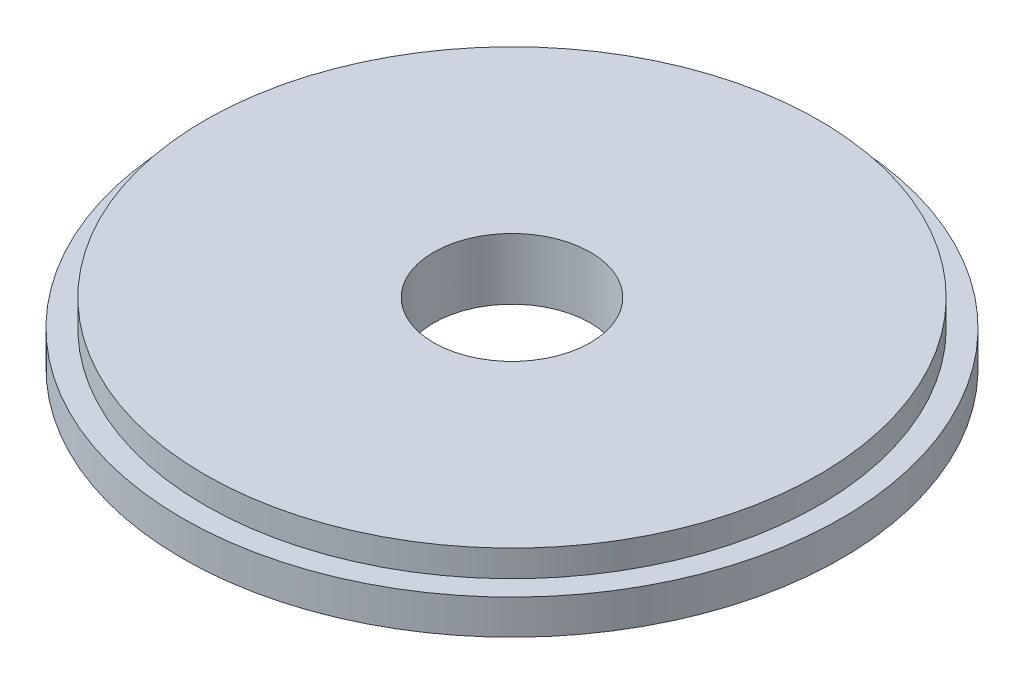
ISO-10303-21;
HEADER;
FILE_DESCRIPTION(('STEP AP214'),'2;1');
FILE_NAME('part.step','',(''),(''),'','','');
FILE_SCHEMA(('AUTOMOTIVE_DESIGN { 1 0 10303 214 1 1 1 1 }'));
ENDSEC;
DATA;
#1=APPLICATION_CONTEXT('core data for automotive mechanical design processes');
#2=APPLICATION_PROTOCOL_DEFINITION('international standard','automotive_design',2000,#1);
#3=PRODUCT_CONTEXT('',#1,'mechanical');
#4=PRODUCT('Part','Part','',(#3));
#5=PRODUCT_RELATED_PRODUCT_CATEGORY('part','',(#4));
#6=PRODUCT_DEFINITION_FORMATION('','',#4);
#7=PRODUCT_DEFINITION_CONTEXT('part definition',#1,'design');
#8=PRODUCT_DEFINITION('design','',#6,#7);
#9=PRODUCT_DEFINITION_SHAPE('','',#8);
#10=(LENGTH_UNIT() NAMED_UNIT(*) SI_UNIT(.MILLI.,.METRE.));
#11=(NAMED_UNIT(*) PLANE_ANGLE_UNIT() SI_UNIT($,.RADIAN.));
#12=(NAMED_UNIT(*) SI_UNIT($,.STERADIAN.) SOLID_ANGLE_UNIT());
#13=UNCERTAINTY_MEASURE_WITH_UNIT(LENGTH_MEASURE(1.E-05),#10,'distance_accuracy_value','');
#14=(GEOMETRIC_REPRESENTATION_CONTEXT(3) GLOBAL_UNCERTAINTY_ASSIGNED_CONTEXT((#13)) GLOBAL_UNIT_ASSIGNED_CONTEXT((#10,
#11,#12)) REPRESENTATION_CONTEXT('',''));
#15=CARTESIAN_POINT('',(0.,0.,0.));
#16=DIRECTION('',(0.,0.,1.));
#17=DIRECTION('',(1.,0.,0.));
#18=AXIS2_PLACEMENT_3D('',#15,#16,#17);
#19=CARTESIAN_POINT('',(0.,2.8829,0.));
#20=DIRECTION('',(0.,-1.,0.));
#21=DIRECTION('',(0.,0.,-1.));
#22=AXIS2_PLACEMENT_3D('',#19,#20,#21);
#23=CYLINDRICAL_SURFACE('',#22,27.325);
#24=CARTESIAN_POINT('',(0.,2.8829,0.));
#25=DIRECTION('',(0.,1.,0.));
#26=DIRECTION('',(0.,0.,1.));
#27=AXIS2_PLACEMENT_3D('',#24,#25,#26);
#28=CIRCLE('',#27,27.325);
#29=CARTESIAN_POINT('',(0.,2.8829,27.325));
#30=VERTEX_POINT('',#29);
#31=EDGE_CURVE('E42',#30,#30,#28,.T.);
#32=ORIENTED_EDGE('',*,*,#31,.F.);
#33=EDGE_LOOP('',(#32));
#34=FACE_BOUND('',#33,.T.);
#35=CARTESIAN_POINT('',(0.,0.,0.));
#36=DIRECTION('',(0.,1.,0.));
#37=DIRECTION('',(0.,0.,1.));
#38=AXIS2_PLACEMENT_3D('',#35,#36,#37);
#39=CIRCLE('',#38,27.325);
#40=CARTESIAN_POINT('',(0.,0.,27.325));
#41=VERTEX_POINT('',#40);
#42=EDGE_CURVE('E47',#41,#41,#39,.T.);
#43=ORIENTED_EDGE('',*,*,#42,.T.);
#44=EDGE_LOOP('',(#43));
#45=FACE_BOUND('',#44,.T.);
#46=ADVANCED_FACE('F35',(#34,#45),#23,.T.);
#47=CARTESIAN_POINT('',(0.,2.8829,0.));
#48=DIRECTION('',(0.,1.,0.));
#49=DIRECTION('',(0.,0.,1.));
#50=AXIS2_PLACEMENT_3D('',#47,#48,#49);
#51=PLANE('',#50);
#52=CARTESIAN_POINT('',(0.,2.8829,0.));
#53=DIRECTION('',(0.,1.,0.));
#54=DIRECTION('',(0.,0.,1.));
#55=AXIS2_PLACEMENT_3D('',#52,#53,#54);
#56=CIRCLE('',#55,25.45715);
#57=CARTESIAN_POINT('',(0.,2.8829,25.45715));
#58=VERTEX_POINT('',#57);
#59=EDGE_CURVE('E10',#58,#58,#56,.T.);
#60=ORIENTED_EDGE('',*,*,#59,.F.);
#61=EDGE_LOOP('',(#60));
#62=FACE_BOUND('',#61,.T.);
#63=ORIENTED_EDGE('',*,*,#31,.T.);
#64=EDGE_LOOP('',(#63));
#65=FACE_BOUND('',#64,.T.);
#66=ADVANCED_FACE('F71',(#62,#65),#51,.T.);
#67=CARTESIAN_POINT('',(0.,0.,0.));
#68=DIRECTION('',(0.,1.,0.));
#69=DIRECTION('',(0.,0.,1.));
#70=AXIS2_PLACEMENT_3D('',#67,#68,#69);
#71=PLANE('',#70);
#72=CARTESIAN_POINT('',(0.,0.,0.));
#73=DIRECTION('',(0.,-1.,0.));
#74=DIRECTION('',(0.,0.,-1.));
#75=AXIS2_PLACEMENT_3D('',#72,#73,#74);
#76=CIRCLE('',#75,6.50059660745584);
#77=CARTESIAN_POINT('',(0.,0.,-6.50059660745584));
#78=VERTEX_POINT('',#77);
#79=EDGE_CURVE('E59',#78,#78,#76,.T.);
#80=ORIENTED_EDGE('',*,*,#79,.F.);
#81=EDGE_LOOP('',(#80));
#82=FACE_BOUND('',#81,.T.);
#83=ORIENTED_EDGE('',*,*,#42,.F.);
#84=EDGE_LOOP('',(#83));
#85=FACE_BOUND('',#84,.T.);
#86=ADVANCED_FACE('F67',(#82,#85),#71,.F.);
#87=CARTESIAN_POINT('',(0.,5.08,0.));
#88=DIRECTION('',(0.,-1.,0.));
#89=DIRECTION('',(0.,0.,-1.));
#90=AXIS2_PLACEMENT_3D('',#87,#88,#89);
#91=CYLINDRICAL_SURFACE('',#90,25.45715);
#92=CARTESIAN_POINT('',(0.,5.08,0.));
#93=DIRECTION('',(0.,1.,0.));
#94=DIRECTION('',(0.,0.,1.));
#95=AXIS2_PLACEMENT_3D('',#92,#93,#94);
#96=CIRCLE('',#95,25.45715);
#97=CARTESIAN_POINT('',(0.,5.08,25.45715));
#98=VERTEX_POINT('',#97);
#99=EDGE_CURVE('E50',#98,#98,#96,.T.);
#100=ORIENTED_EDGE('',*,*,#99,.F.);
#101=EDGE_LOOP('',(#100));
#102=FACE_BOUND('',#101,.T.);
#103=ORIENTED_EDGE('',*,*,#59,.T.);
#104=EDGE_LOOP('',(#103));
#105=FACE_BOUND('',#104,.T.);
#106=ADVANCED_FACE('F70',(#102,#105),#91,.T.);
#107=CARTESIAN_POINT('',(0.,5.08,0.));
#108=DIRECTION('',(0.,1.,0.));
#109=DIRECTION('',(0.,0.,1.));
#110=AXIS2_PLACEMENT_3D('',#107,#108,#109);
#111=PLANE('',#110);
#112=CARTESIAN_POINT('',(0.,5.08,0.));
#113=DIRECTION('',(0.,1.,0.));
#114=DIRECTION('',(0.,0.,1.));
#115=AXIS2_PLACEMENT_3D('',#112,#113,#114);
#116=CIRCLE('',#115,6.50059660745584);
#117=CARTESIAN_POINT('',(0.,5.08,6.50059660745584));
#118=VERTEX_POINT('',#117);
#119=EDGE_CURVE('E38',#118,#118,#116,.T.);
#120=ORIENTED_EDGE('',*,*,#119,.F.);
#121=EDGE_LOOP('',(#120));
#122=FACE_BOUND('',#121,.T.);
#123=ORIENTED_EDGE('',*,*,#99,.T.);
#124=EDGE_LOOP('',(#123));
#125=FACE_BOUND('',#124,.T.);
#126=ADVANCED_FACE('F76',(#122,#125),#111,.T.);
#127=CARTESIAN_POINT('',(0.,25.4,0.));
#128=DIRECTION('',(0.,-1.,0.));
#129=DIRECTION('',(0.,0.,-1.));
#130=AXIS2_PLACEMENT_3D('',#127,#128,#129);
#131=CYLINDRICAL_SURFACE('',#130,6.50059660745584);
#132=ORIENTED_EDGE('',*,*,#119,.T.);
#133=EDGE_LOOP('',(#132));
#134=FACE_BOUND('',#133,.T.);
#135=ORIENTED_EDGE('',*,*,#79,.T.);
#136=EDGE_LOOP('',(#135));
#137=FACE_BOUND('',#136,.T.);
#138=ADVANCED_FACE('F65',(#134,#137),#131,.F.);
#139=CLOSED_SHELL('',(#46,#66,#86,#106,#126,#138));
#140=MANIFOLD_SOLID_BREP('B2',#139);
#141=ADVANCED_BREP_SHAPE_REPRESENTATION('',(#18,#140),#14);
#142=SHAPE_DEFINITION_REPRESENTATION(#9,#141);
ENDSEC;
END-ISO-10303-21;
